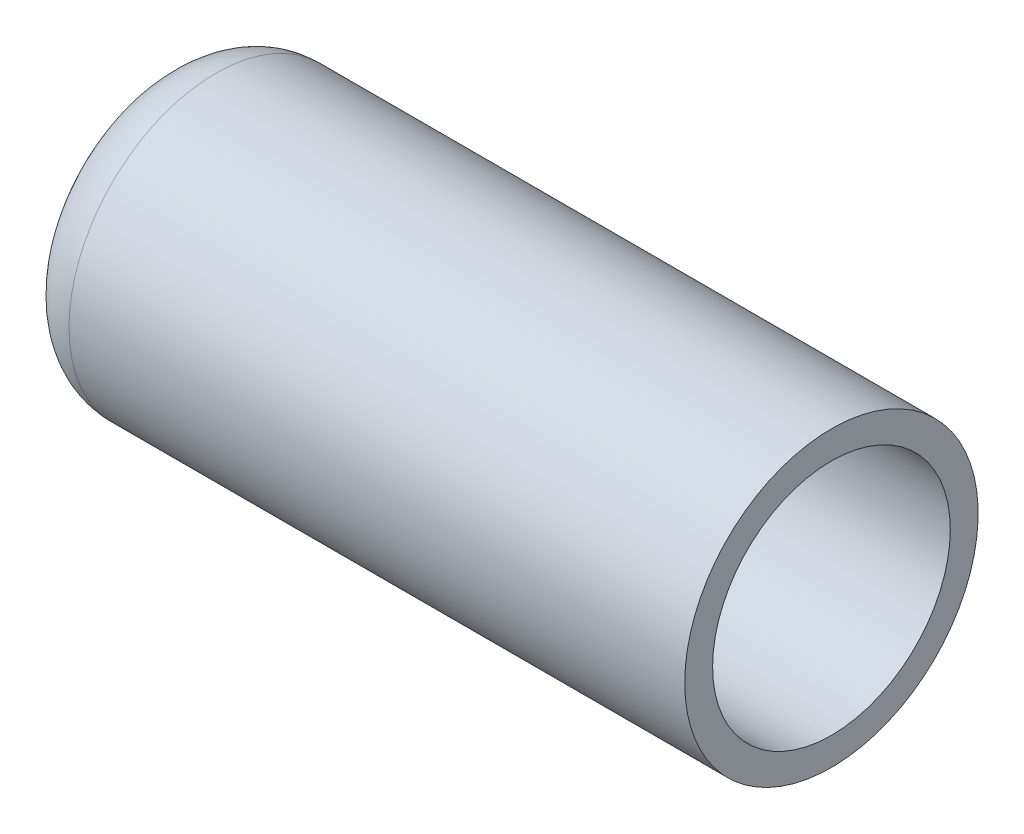
ISO-10303-21;
HEADER;
FILE_DESCRIPTION(('STEP AP214'),'2;1');
FILE_NAME('part.step','',(''),(''),'','','');
FILE_SCHEMA(('AUTOMOTIVE_DESIGN { 1 0 10303 214 1 1 1 1 }'));
ENDSEC;
DATA;
#1=APPLICATION_CONTEXT('core data for automotive mechanical design processes');
#2=APPLICATION_PROTOCOL_DEFINITION('international standard','automotive_design',2000,#1);
#3=PRODUCT_CONTEXT('',#1,'mechanical');
#4=PRODUCT('Part','Part','',(#3));
#5=PRODUCT_RELATED_PRODUCT_CATEGORY('part','',(#4));
#6=PRODUCT_DEFINITION_FORMATION('','',#4);
#7=PRODUCT_DEFINITION_CONTEXT('part definition',#1,'design');
#8=PRODUCT_DEFINITION('design','',#6,#7);
#9=PRODUCT_DEFINITION_SHAPE('','',#8);
#10=(LENGTH_UNIT() NAMED_UNIT(*) SI_UNIT(.MILLI.,.METRE.));
#11=(NAMED_UNIT(*) PLANE_ANGLE_UNIT() SI_UNIT($,.RADIAN.));
#12=(NAMED_UNIT(*) SI_UNIT($,.STERADIAN.) SOLID_ANGLE_UNIT());
#13=UNCERTAINTY_MEASURE_WITH_UNIT(LENGTH_MEASURE(1.E-05),#10,'distance_accuracy_value','');
#14=(GEOMETRIC_REPRESENTATION_CONTEXT(3) GLOBAL_UNCERTAINTY_ASSIGNED_CONTEXT((#13)) GLOBAL_UNIT_ASSIGNED_CONTEXT((#10,
#11,#12)) REPRESENTATION_CONTEXT('',''));
#15=CARTESIAN_POINT('',(0.,0.,0.));
#16=DIRECTION('',(0.,0.,1.));
#17=DIRECTION('',(1.,0.,0.));
#18=AXIS2_PLACEMENT_3D('',#15,#16,#17);
#19=CARTESIAN_POINT('',(-26.9999999999999,0.,0.));
#20=DIRECTION('',(0.,0.,1.));
#21=DIRECTION('',(-1.,0.,0.));
#22=AXIS2_PLACEMENT_3D('',#19,#20,#21);
#23=SPHERICAL_SURFACE('',#22,18.1000000000001);
#24=CARTESIAN_POINT('',(-43.721974953587,0.,0.));
#25=DIRECTION('',(-1.,0.,0.));
#26=DIRECTION('',(0.,0.,1.));
#27=AXIS2_PLACEMENT_3D('',#24,#25,#26);
#28=CIRCLE('',#27,6.92716057642722);
#29=CARTESIAN_POINT('',(-43.721974953587,0.,6.92716057642722));
#30=VERTEX_POINT('',#29);
#31=EDGE_CURVE('E17',#30,#30,#28,.T.);
#32=ORIENTED_EDGE('',*,*,#31,.F.);
#33=EDGE_LOOP('',(#32));
#34=FACE_BOUND('',#33,.T.);
#35=ADVANCED_FACE('F13',(#34),#23,.F.);
#36=CARTESIAN_POINT('',(-41.9666295470958,0.,0.));
#37=DIRECTION('',(-1.,0.,0.));
#38=DIRECTION('',(0.,0.,1.));
#39=AXIS2_PLACEMENT_3D('',#36,#37,#38);
#40=TOROIDAL_SURFACE('',#39,6.2,1.9);
#41=CARTESIAN_POINT('',(-41.9666295470958,0.,0.));
#42=DIRECTION('',(-1.,0.,0.));
#43=DIRECTION('',(0.,1.,0.));
#44=AXIS2_PLACEMENT_3D('',#41,#42,#43);
#45=CIRCLE('',#44,8.1);
#46=CARTESIAN_POINT('',(-41.9666295470958,8.1,0.));
#47=VERTEX_POINT('',#46);
#48=EDGE_CURVE('E34',#47,#47,#45,.T.);
#49=ORIENTED_EDGE('',*,*,#48,.F.);
#50=EDGE_LOOP('',(#49));
#51=FACE_BOUND('',#50,.T.);
#52=ORIENTED_EDGE('',*,*,#31,.T.);
#53=EDGE_LOOP('',(#52));
#54=FACE_BOUND('',#53,.T.);
#55=ADVANCED_FACE('F44',(#51,#54),#40,.F.);
#56=CARTESIAN_POINT('',(0.,0.,0.));
#57=DIRECTION('',(-1.,0.,0.));
#58=DIRECTION('',(0.,0.,1.));
#59=AXIS2_PLACEMENT_3D('',#56,#57,#58);
#60=CYLINDRICAL_SURFACE('',#59,8.1);
#61=CARTESIAN_POINT('',(0.,0.,0.));
#62=DIRECTION('',(-1.,0.,0.));
#63=DIRECTION('',(0.,0.,1.));
#64=AXIS2_PLACEMENT_3D('',#61,#62,#63);
#65=CIRCLE('',#64,8.1);
#66=CARTESIAN_POINT('',(0.,0.,8.1));
#67=VERTEX_POINT('',#66);
#68=EDGE_CURVE('E32',#67,#67,#65,.T.);
#69=ORIENTED_EDGE('',*,*,#68,.F.);
#70=EDGE_LOOP('',(#69));
#71=FACE_BOUND('',#70,.T.);
#72=ORIENTED_EDGE('',*,*,#48,.T.);
#73=EDGE_LOOP('',(#72));
#74=FACE_BOUND('',#73,.T.);
#75=ADVANCED_FACE('F47',(#71,#74),#60,.F.);
#76=CARTESIAN_POINT('',(0.,10.,10.1200021082709));
#77=DIRECTION('',(1.,0.,0.));
#78=DIRECTION('',(0.,-1.,0.));
#79=AXIS2_PLACEMENT_3D('',#76,#77,#78);
#80=PLANE('',#79);
#81=ORIENTED_EDGE('',*,*,#68,.T.);
#82=EDGE_LOOP('',(#81));
#83=FACE_BOUND('',#82,.T.);
#84=CARTESIAN_POINT('',(0.,0.,0.));
#85=DIRECTION('',(-1.,0.,0.));
#86=DIRECTION('',(0.,0.,1.));
#87=AXIS2_PLACEMENT_3D('',#84,#85,#86);
#88=CIRCLE('',#87,10.);
#89=CARTESIAN_POINT('',(0.,0.,10.));
#90=VERTEX_POINT('',#89);
#91=EDGE_CURVE('E26',#90,#90,#88,.T.);
#92=ORIENTED_EDGE('',*,*,#91,.F.);
#93=EDGE_LOOP('',(#92));
#94=FACE_BOUND('',#93,.T.);
#95=ADVANCED_FACE('F51',(#83,#94),#80,.T.);
#96=CARTESIAN_POINT('',(-41.9666295470958,0.,0.));
#97=DIRECTION('',(-1.,0.,0.));
#98=DIRECTION('',(0.,0.,1.));
#99=AXIS2_PLACEMENT_3D('',#96,#97,#98);
#100=CYLINDRICAL_SURFACE('',#99,10.);
#101=ORIENTED_EDGE('',*,*,#91,.T.);
#102=EDGE_LOOP('',(#101));
#103=FACE_BOUND('',#102,.T.);
#104=CARTESIAN_POINT('',(-41.9666295470958,0.,0.));
#105=DIRECTION('',(-1.,0.,0.));
#106=DIRECTION('',(0.,0.,1.));
#107=AXIS2_PLACEMENT_3D('',#104,#105,#106);
#108=CIRCLE('',#107,10.);
#109=CARTESIAN_POINT('',(-41.9666295470958,0.,10.));
#110=VERTEX_POINT('',#109);
#111=EDGE_CURVE('E21',#110,#110,#108,.T.);
#112=ORIENTED_EDGE('',*,*,#111,.F.);
#113=EDGE_LOOP('',(#112));
#114=FACE_BOUND('',#113,.T.);
#115=ADVANCED_FACE('F55',(#103,#114),#100,.T.);
#116=CARTESIAN_POINT('',(-41.9666295470958,0.,0.));
#117=DIRECTION('',(-1.,0.,0.));
#118=DIRECTION('',(0.,0.,1.));
#119=AXIS2_PLACEMENT_3D('',#116,#117,#118);
#120=TOROIDAL_SURFACE('',#119,6.20000000000001,3.79999999999999);
#121=ORIENTED_EDGE('',*,*,#111,.T.);
#122=EDGE_LOOP('',(#121));
#123=FACE_BOUND('',#122,.T.);
#124=CARTESIAN_POINT('',(-45.4773204285133,0.,0.));
#125=DIRECTION('',(-1.,0.,0.));
#126=DIRECTION('',(0.,0.,1.));
#127=AXIS2_PLACEMENT_3D('',#124,#125,#126);
#128=CIRCLE('',#127,7.65432098765433);
#129=CARTESIAN_POINT('',(-45.4773204285133,0.,7.65432098765433));
#130=VERTEX_POINT('',#129);
#131=EDGE_CURVE('E8',#130,#130,#128,.T.);
#132=ORIENTED_EDGE('',*,*,#131,.F.);
#133=EDGE_LOOP('',(#132));
#134=FACE_BOUND('',#133,.T.);
#135=ADVANCED_FACE('F58',(#123,#134),#120,.T.);
#136=CARTESIAN_POINT('',(-27.0000000000003,0.,0.));
#137=DIRECTION('',(0.,0.,1.));
#138=DIRECTION('',(1.,0.,0.));
#139=AXIS2_PLACEMENT_3D('',#136,#137,#138);
#140=SPHERICAL_SURFACE('',#139,19.9999999999997);
#141=ORIENTED_EDGE('',*,*,#131,.T.);
#142=EDGE_LOOP('',(#141));
#143=FACE_BOUND('',#142,.T.);
#144=ADVANCED_FACE('F62',(#143),#140,.T.);
#145=CLOSED_SHELL('',(#35,#55,#75,#95,#115,#135,#144));
#146=MANIFOLD_SOLID_BREP('B1',#145);
#147=ADVANCED_BREP_SHAPE_REPRESENTATION('',(#18,#146),#14);
#148=SHAPE_DEFINITION_REPRESENTATION(#9,#147);
ENDSEC;
END-ISO-10303-21;
